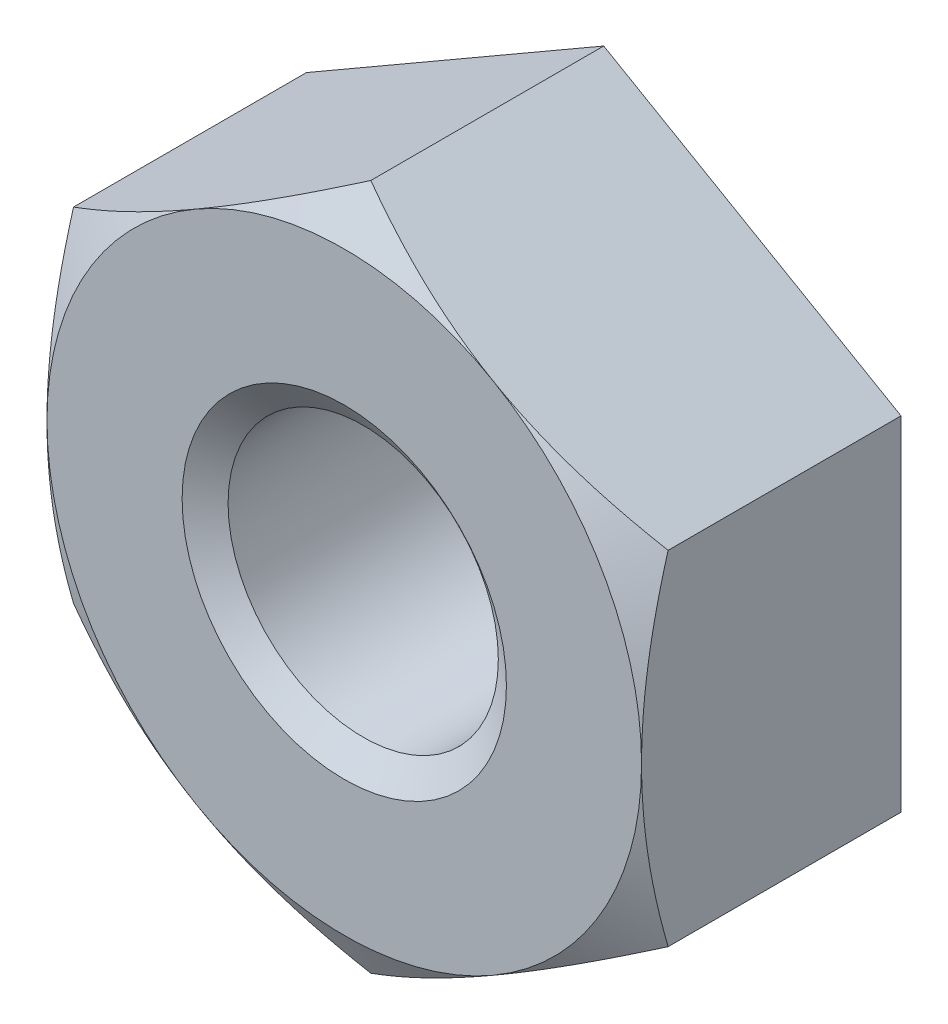
ISO-10303-21;
HEADER;
FILE_DESCRIPTION(('STEP AP214'),'2;1');
FILE_NAME('part.step','',(''),(''),'','','');
FILE_SCHEMA(('AUTOMOTIVE_DESIGN { 1 0 10303 214 1 1 1 1 }'));
ENDSEC;
DATA;
#1=APPLICATION_CONTEXT('core data for automotive mechanical design processes');
#2=APPLICATION_PROTOCOL_DEFINITION('international standard','automotive_design',2000,#1);
#3=PRODUCT_CONTEXT('',#1,'mechanical');
#4=PRODUCT('Part','Part','',(#3));
#5=PRODUCT_RELATED_PRODUCT_CATEGORY('part','',(#4));
#6=PRODUCT_DEFINITION_FORMATION('','',#4);
#7=PRODUCT_DEFINITION_CONTEXT('part definition',#1,'design');
#8=PRODUCT_DEFINITION('design','',#6,#7);
#9=PRODUCT_DEFINITION_SHAPE('','',#8);
#10=(LENGTH_UNIT() NAMED_UNIT(*) SI_UNIT(.MILLI.,.METRE.));
#11=(NAMED_UNIT(*) PLANE_ANGLE_UNIT() SI_UNIT($,.RADIAN.));
#12=(NAMED_UNIT(*) SI_UNIT($,.STERADIAN.) SOLID_ANGLE_UNIT());
#13=UNCERTAINTY_MEASURE_WITH_UNIT(LENGTH_MEASURE(1.E-05),#10,'distance_accuracy_value','');
#14=(GEOMETRIC_REPRESENTATION_CONTEXT(3) GLOBAL_UNCERTAINTY_ASSIGNED_CONTEXT((#13)) GLOBAL_UNIT_ASSIGNED_CONTEXT((#10,
#11,#12)) REPRESENTATION_CONTEXT('',''));
#15=CARTESIAN_POINT('',(0.,0.,0.));
#16=DIRECTION('',(0.,0.,1.));
#17=DIRECTION('',(1.,0.,0.));
#18=AXIS2_PLACEMENT_3D('',#15,#16,#17);
#19=CARTESIAN_POINT('',(0.,0.,-0.247093813584343));
#20=DIRECTION('',(0.,0.,-1.));
#21=DIRECTION('',(-1.,0.,0.));
#22=AXIS2_PLACEMENT_3D('',#19,#20,#21);
#23=CONICAL_SURFACE('',#22,3.17797903937844,1.04719755116195);
#24=CARTESIAN_POINT('',(0.,0.,0.));
#25=DIRECTION('',(0.,0.,-1.));
#26=DIRECTION('',(-1.,0.,0.));
#27=AXIS2_PLACEMENT_3D('',#24,#25,#26);
#28=CIRCLE('',#27,2.75000000004866);
#29=CARTESIAN_POINT('',(1.37500000001217,-2.38156986042828,1.40440906938991E-11));
#30=VERTEX_POINT('',#29);
#31=CARTESIAN_POINT('',(2.75000000002433,0.,1.40464067622389E-11));
#32=VERTEX_POINT('',#31);
#33=EDGE_CURVE('E97',#30,#32,#28,.F.);
#34=ORIENTED_EDGE('',*,*,#33,.F.);
#35=CARTESIAN_POINT('',(1.37500000000305,-2.38156986041248,3.15982768511654E-11));
#36=CARTESIAN_POINT('',(1.43336103763303,-2.34787509962212,1.12391778319675E-05));
#37=CARTESIAN_POINT('',(1.49171926381489,-2.31418196202475,-0.0014298847914334));
#38=CARTESIAN_POINT('',(1.60832112896877,-2.24686184378879,-0.00713332387259725));
#39=CARTESIAN_POINT('',(1.66656478833645,-2.21323485137477,-0.011395080477685));
#40=CARTESIAN_POINT('',(1.7825613120327,-2.14626422719404,-0.0226281862687476));
#41=CARTESIAN_POINT('',(1.8403151747034,-2.11292001903424,-0.0295858947593137));
#42=CARTESIAN_POINT('',(1.95554774065357,-2.0463904660634,-0.0460612413437182));
#43=CARTESIAN_POINT('',(2.01302643664991,-2.01320512545727,-0.0555789468186311));
#44=CARTESIAN_POINT('',(2.18481152064584,-1.91402496096951,-0.0876780317375557));
#45=CARTESIAN_POINT('',(2.29861886652214,-1.84831825919206,-0.113820966090652));
#46=CARTESIAN_POINT('',(2.52525486505283,-1.71746990443227,-0.17411325931236));
#47=CARTESIAN_POINT('',(2.63807561243877,-1.6523328155588,-0.208302603648988));
#48=CARTESIAN_POINT('',(2.75000002885947,-1.58771322360946,-0.24562010267325));
#49=B_SPLINE_CURVE_WITH_KNOTS('',3,(#35,#36,#37,#38,#39,#40,#41,#42,#43,#44,#45,#46,#47,#48),
.UNSPECIFIED.,.F.,.F.,(4,2,2,2,2,2,4),(0.,0.202147933050163,0.404255851235435,0.605354244075444,
0.806457930496686,1.20813821480532,1.61185838562082),.UNSPECIFIED.);
#50=CARTESIAN_POINT('',(2.75000001442973,-1.58771323194047,-0.245620097863339));
#51=VERTEX_POINT('',#50);
#52=EDGE_CURVE('E93',#30,#51,#49,.T.);
#53=ORIENTED_EDGE('',*,*,#52,.T.);
#54=CARTESIAN_POINT('',(2.75,-1.58771315362291,-0.245620068040142));
#55=CARTESIAN_POINT('',(2.75,-1.45847397917815,-0.208302573849282));
#56=CARTESIAN_POINT('',(2.75,-1.32819981103504,-0.174113234121537));
#57=CARTESIAN_POINT('',(2.75,-1.06650312090967,-0.113820949233789));
#58=CARTESIAN_POINT('',(2.75,-0.935089727142611,-0.0876780186143448));
#59=CARTESIAN_POINT('',(2.75,-0.736729413107964,-0.0555789383880814));
#60=CARTESIAN_POINT('',(2.75,-0.670358736932504,-0.0460612343275955));
#61=CARTESIAN_POINT('',(2.75,-0.537299641131988,-0.0295858902143288));
#62=CARTESIAN_POINT('',(2.75,-0.470611229916765,-0.0226281827805123));
#63=CARTESIAN_POINT('',(2.75,-0.336669991876295,-0.0113950787090329));
#64=CARTESIAN_POINT('',(2.75,-0.269416012265235,-0.00713332276330057));
#65=CARTESIAN_POINT('',(2.75,-0.134775786263297,-0.00142988456893094));
#66=CARTESIAN_POINT('',(2.75,-0.0673895163215359,1.12391731505966E-05));
#67=CARTESIAN_POINT('',(2.75,1.01420511404254E-12,2.80927633852003E-11));
#68=B_SPLINE_CURVE_WITH_KNOTS('',3,(#54,#55,#56,#57,#58,#59,#60,#61,#62,#63,#64,#65,#66,#67),
.UNSPECIFIED.,.F.,.F.,(4,2,2,2,2,2,4),(0.,0.403720139495963,0.805400392863833,1.00650406373458,
1.20760244102681,1.40971034347854,1.61185826077991),.UNSPECIFIED.);
#69=EDGE_CURVE('E22',#51,#32,#68,.T.);
#70=ORIENTED_EDGE('',*,*,#69,.T.);
#71=EDGE_LOOP('',(#34,#53,#70));
#72=FACE_BOUND('',#71,.T.);
#73=ADVANCED_FACE('F18',(#72),#23,.T.);
#74=CARTESIAN_POINT('',(0.,0.,-0.247093813584343));
#75=DIRECTION('',(0.,0.,-1.));
#76=DIRECTION('',(-1.,0.,0.));
#77=AXIS2_PLACEMENT_3D('',#74,#75,#76);
#78=CONICAL_SURFACE('',#77,3.17797903937844,1.04719755116195);
#79=CARTESIAN_POINT('',(2.75000000000608,0.,3.16041922148982E-11));
#80=CARTESIAN_POINT('',(2.75000000000218,0.0673895163223448,1.1239174398227E-05));
#81=CARTESIAN_POINT('',(2.75000000000058,0.134775786263928,-0.00142988456861291));
#82=CARTESIAN_POINT('',(2.74999999999941,0.269416012265561,-0.00713332276365896));
#83=CARTESIAN_POINT('',(2.74999999999984,0.336669991876494,-0.0113950787091394));
#84=CARTESIAN_POINT('',(2.75000000000016,0.470611229916732,-0.0226281827804203));
#85=CARTESIAN_POINT('',(2.75000000000004,0.537299641131852,-0.02958589021429));
#86=CARTESIAN_POINT('',(2.74999999999996,0.670358736932153,-0.0460612343275735));
#87=CARTESIAN_POINT('',(2.74999999999998,0.736729413107504,-0.0555789383880228));
#88=CARTESIAN_POINT('',(2.75000000000003,0.9350897271419,-0.0876780186141979));
#89=CARTESIAN_POINT('',(2.75000000000002,1.06650312090882,-0.113820949233605));
#90=CARTESIAN_POINT('',(2.74999999999998,1.32819981103387,-0.174113234121255));
#91=CARTESIAN_POINT('',(2.74999999999997,1.4584739791768,-0.208302573848937));
#92=CARTESIAN_POINT('',(2.75,1.58771315362139,-0.245620068039702));
#93=B_SPLINE_CURVE_WITH_KNOTS('',3,(#79,#80,#81,#82,#83,#84,#85,#86,#87,#88,#89,#90,#91,#92),
.UNSPECIFIED.,.F.,.F.,(4,2,2,2,2,2,4),(0.,0.202147917300899,0.404255819752228,0.605354197044146,
0.806457867914559,1.20813812128199,1.61185826077738),.UNSPECIFIED.);
#94=CARTESIAN_POINT('',(2.75,1.58771319694643,-0.245620080546563));
#95=VERTEX_POINT('',#94);
#96=EDGE_CURVE('E101',#32,#95,#93,.T.);
#97=ORIENTED_EDGE('',*,*,#96,.T.);
#98=CARTESIAN_POINT('',(2.75000002886078,1.58771322360869,-0.245620102673686));
#99=CARTESIAN_POINT('',(2.63807561243995,1.65233281555815,-0.208302603649328));
#100=CARTESIAN_POINT('',(2.52525486505385,1.71746990443169,-0.174113259312637));
#101=CARTESIAN_POINT('',(2.29861886652286,1.84831825919161,-0.113820966090832));
#102=CARTESIAN_POINT('',(2.18481152064644,1.91402496096912,-0.0876780317376984));
#103=CARTESIAN_POINT('',(2.01302643665031,2.01320512545705,-0.0555789468186852));
#104=CARTESIAN_POINT('',(1.95554774065389,2.04639046606325,-0.0460612413437356));
#105=CARTESIAN_POINT('',(1.84031517470349,2.11292001903413,-0.0295858947593481));
#106=CARTESIAN_POINT('',(1.78256131203265,2.14626422719388,-0.0226281862688354));
#107=CARTESIAN_POINT('',(1.66656478833636,2.21323485137499,-0.0113950804775746));
#108=CARTESIAN_POINT('',(1.60832112896878,2.24686184378946,-0.00713332387223494));
#109=CARTESIAN_POINT('',(1.49171926381405,2.31418196202455,-0.00142988479174703));
#110=CARTESIAN_POINT('',(1.43336103763123,2.34787509962063,1.12391765892145E-05));
#111=CARTESIAN_POINT('',(1.37499999999913,2.38156986040771,2.80925661016851E-11));
#112=B_SPLINE_CURVE_WITH_KNOTS('',3,(#98,#99,#100,#101,#102,#103,#104,#105,#106,#107,#108,#109,
#110,#111),.UNSPECIFIED.,.F.,.F.,(4,2,2,2,2,2,4),(0.,0.403720170816071,0.805400455125145,
1.00650414154672,1.20760253438704,1.40971045257271,1.61185838562335),.UNSPECIFIED.);
#113=CARTESIAN_POINT('',(1.37500000001217,2.38156986042827,1.40462830508427E-11));
#114=VERTEX_POINT('',#113);
#115=EDGE_CURVE('E119',#95,#114,#112,.T.);
#116=ORIENTED_EDGE('',*,*,#115,.T.);
#117=CARTESIAN_POINT('',(0.,0.,0.));
#118=DIRECTION('',(0.,0.,-1.));
#119=DIRECTION('',(-1.,0.,0.));
#120=AXIS2_PLACEMENT_3D('',#117,#118,#119);
#121=CIRCLE('',#120,2.75000000004866);
#122=EDGE_CURVE('E122',#32,#114,#121,.F.);
#123=ORIENTED_EDGE('',*,*,#122,.F.);
#124=EDGE_LOOP('',(#97,#116,#123));
#125=FACE_BOUND('',#124,.T.);
#126=ADVANCED_FACE('F123',(#125),#78,.T.);
#127=CARTESIAN_POINT('',(0.,0.,-0.247093813584343));
#128=DIRECTION('',(0.,0.,-1.));
#129=DIRECTION('',(-1.,0.,0.));
#130=AXIS2_PLACEMENT_3D('',#127,#128,#129);
#131=CONICAL_SURFACE('',#130,3.17797903937844,1.04719755116195);
#132=CARTESIAN_POINT('',(1.37500000000304,2.38156986041247,3.16043386343359E-11));
#133=CARTESIAN_POINT('',(1.31663896691706,2.41526461857035,1.12391743982664E-05));
#134=CARTESIAN_POINT('',(1.25828074528043,2.44895775353984,-0.00142988456862009));
#135=CARTESIAN_POINT('',(1.14167888919086,2.51627786653981,-0.00713332276369414));
#136=CARTESIAN_POINT('',(1.08343523434227,2.54990485634573,-0.0113950787091953));
#137=CARTESIAN_POINT('',(0.967438719584958,2.61687547536628,-0.0226281827805304));
#138=CARTESIAN_POINT('',(0.909684861334445,2.65021968097382,-0.0295858902144335));
#139=CARTESIAN_POINT('',(0.794452304166478,2.71674922887406,-0.0460612343277948));
#140=CARTESIAN_POINT('',(0.73697361253215,2.74993456696184,-0.0555789383882885));
#141=CARTESIAN_POINT('',(0.56518854147532,2.84911472397931,-0.0876780186146111));
#142=CARTESIAN_POINT('',(0.451381204075368,2.91482142086291,-0.113820949234135));
#143=CARTESIAN_POINT('',(0.224745222340224,3.04566976592572,-0.174113234122048));
#144=CARTESIAN_POINT('',(0.111924483271289,3.11080684999732,-0.208302573849875));
#145=CARTESIAN_POINT('',(7.50379077655256E-08,3.17542643721979,-0.245620068040792));
#146=B_SPLINE_CURVE_WITH_KNOTS('',3,(#132,#133,#134,#135,#136,#137,#138,#139,#140,#141,#142,
#143,#144,#145),.UNSPECIFIED.,.F.,.F.,(4,2,2,2,2,2,4),(0.,0.202147917301394,0.404255819753219,
0.605354197045627,0.806457867916529,1.20813812128493,1.61185826078131),.UNSPECIFIED.);
#147=CARTESIAN_POINT('',(3.75189542720857E-08,3.17542645888137,-0.24562008054711));
#148=VERTEX_POINT('',#147);
#149=EDGE_CURVE('E188',#114,#148,#146,.T.);
#150=ORIENTED_EDGE('',*,*,#149,.T.);
#151=CARTESIAN_POINT('',(2.88575171038922E-08,3.17542649720384,-0.2456201026726));
#152=CARTESIAN_POINT('',(-0.11192438756306,3.11080690525453,-0.208302603648394));
#153=CARTESIAN_POINT('',(-0.224745134948901,3.04566981638114,-0.174113259311847));
#154=CARTESIAN_POINT('',(-0.451381133479358,2.91482146162152,-0.113820966090303));
#155=CARTESIAN_POINT('',(-0.565188479355519,2.84911475984416,-0.0876780317372874));
#156=CARTESIAN_POINT('',(-0.736973563351236,2.74993459535647,-0.0555789468184209));
#157=CARTESIAN_POINT('',(-0.794452259347522,2.71674925475034,-0.0460612413435154));
#158=CARTESIAN_POINT('',(-0.909684825297646,2.65021970177963,-0.0295858947592054));
#159=CARTESIAN_POINT('',(-0.967438687968351,2.61687549361996,-0.022628186268726));
#160=CARTESIAN_POINT('',(-1.08343521166436,2.549904869439,-0.0113950804775193));
#161=CARTESIAN_POINT('',(-1.1416788710318,2.51627787702462,-0.0071333238722001));
#162=CARTESIAN_POINT('',(-1.25828073618624,2.4489577587897,-0.0014298847917397));
#163=CARTESIAN_POINT('',(-1.31663896236892,2.4152646211937,1.1239176589549E-05));
#164=CARTESIAN_POINT('',(-1.37500000000088,2.3815698604067,2.80927959761926E-11));
#165=B_SPLINE_CURVE_WITH_KNOTS('',3,(#151,#152,#153,#154,#155,#156,#157,#158,#159,#160,#161,
#162,#163,#164),.UNSPECIFIED.,.F.,.F.,(4,2,2,2,2,2,4),(0.,0.40372017081509,0.805400455123193,
1.00650414154428,1.20760253438411,1.40971045256929,1.61185838561943),.UNSPECIFIED.);
#166=CARTESIAN_POINT('',(-1.37500000001217,2.38156986042827,1.40462921826329E-11));
#167=VERTEX_POINT('',#166);
#168=EDGE_CURVE('E182',#148,#167,#165,.T.);
#169=ORIENTED_EDGE('',*,*,#168,.T.);
#170=CARTESIAN_POINT('',(0.,0.,0.));
#171=DIRECTION('',(0.,0.,-1.));
#172=DIRECTION('',(-1.,0.,0.));
#173=AXIS2_PLACEMENT_3D('',#170,#171,#172);
#174=CIRCLE('',#173,2.75000000004866);
#175=EDGE_CURVE('E127',#114,#167,#174,.F.);
#176=ORIENTED_EDGE('',*,*,#175,.F.);
#177=EDGE_LOOP('',(#150,#169,#176));
#178=FACE_BOUND('',#177,.T.);
#179=ADVANCED_FACE('F173',(#178),#131,.T.);
#180=CARTESIAN_POINT('',(0.,0.,-0.247093813584343));
#181=DIRECTION('',(0.,0.,-1.));
#182=DIRECTION('',(-1.,0.,0.));
#183=AXIS2_PLACEMENT_3D('',#180,#181,#182);
#184=CONICAL_SURFACE('',#183,3.17797903937844,1.04719755116195);
#185=CARTESIAN_POINT('',(0.,0.,0.));
#186=DIRECTION('',(0.,0.,-1.));
#187=DIRECTION('',(-1.,0.,0.));
#188=AXIS2_PLACEMENT_3D('',#185,#186,#187);
#189=CIRCLE('',#188,2.75000000004866);
#190=CARTESIAN_POINT('',(-2.75000000002433,0.,1.40463935830133E-11));
#191=VERTEX_POINT('',#190);
#192=EDGE_CURVE('E129',#167,#191,#189,.F.);
#193=ORIENTED_EDGE('',*,*,#192,.F.);
#194=CARTESIAN_POINT('',(-1.37500000000304,2.38156986041247,3.16045264236607E-11));
#195=CARTESIAN_POINT('',(-1.43336103763308,2.34787509962208,1.12391778372063E-05));
#196=CARTESIAN_POINT('',(-1.49171926381501,2.31418196202467,-0.00142988479143164));
#197=CARTESIAN_POINT('',(-1.608321128969,2.24686184378865,-0.00713332387260752));
#198=CARTESIAN_POINT('',(-1.66656478833674,2.21323485137459,-0.0113950804777039));
#199=CARTESIAN_POINT('',(-1.78256131203311,2.14626422719379,-0.0226281862687886));
#200=CARTESIAN_POINT('',(-1.84031517470386,2.11292001903396,-0.0295858947593684));
#201=CARTESIAN_POINT('',(-1.95554774065415,2.04639046606305,-0.046061241343805));
#202=CARTESIAN_POINT('',(-2.01302643665055,2.0132051254569,-0.0555789468187364));
#203=CARTESIAN_POINT('',(-2.18481152064664,1.91402496096904,-0.0876780317377223));
#204=CARTESIAN_POINT('',(-2.29861886652305,1.84831825919152,-0.113820966090867));
#205=CARTESIAN_POINT('',(-2.52525486505396,1.7174699044316,-0.174113259312683));
#206=CARTESIAN_POINT('',(-2.63807561244001,1.65233281555808,-0.208302603649372));
#207=CARTESIAN_POINT('',(-2.75000002886081,1.58771322360867,-0.245620102673697));
#208=B_SPLINE_CURVE_WITH_KNOTS('',3,(#194,#195,#196,#197,#198,#199,#200,#201,#202,#203,#204,
#205,#206,#207),.UNSPECIFIED.,.F.,.F.,(4,2,2,2,2,2,4),(0.,0.202147933050368,0.404255851235844,
0.605354244076056,0.8064579304975,1.20813821480654,1.61185838562244),.UNSPECIFIED.);
#209=CARTESIAN_POINT('',(-2.75000001443041,1.58771323194007,-0.245620097863561));
#210=VERTEX_POINT('',#209);
#211=EDGE_CURVE('E204',#167,#210,#208,.T.);
#212=ORIENTED_EDGE('',*,*,#211,.T.);
#213=CARTESIAN_POINT('',(-2.75,1.58771315362135,-0.245620068039692));
#214=CARTESIAN_POINT('',(-2.75,1.45847397917674,-0.208302573848903));
#215=CARTESIAN_POINT('',(-2.75,1.32819981103379,-0.174113234121225));
#216=CARTESIAN_POINT('',(-2.75,1.06650312090873,-0.113820949233596));
#217=CARTESIAN_POINT('',(-2.75,0.935089727141834,-0.0876780186142038));
#218=CARTESIAN_POINT('',(-2.75,0.736729413107428,-0.0555789383880021));
#219=CARTESIAN_POINT('',(-2.75,0.67035873693205,-0.0460612343275341));
#220=CARTESIAN_POINT('',(-2.75,0.537299641131698,-0.0295858902142976));
#221=CARTESIAN_POINT('',(-2.75,0.470611229916558,-0.0226281827804933));
#222=CARTESIAN_POINT('',(-2.75,0.336669991876254,-0.0113950787090315));
#223=CARTESIAN_POINT('',(-2.75,0.269416012265279,-0.00713332276330436));
#224=CARTESIAN_POINT('',(-2.75,0.134775786263509,-0.00142988456893813));
#225=CARTESIAN_POINT('',(-2.75,0.0673895163218324,1.12391731452491E-05));
#226=CARTESIAN_POINT('',(-2.75,-6.33431828541127E-13,2.80927558678057E-11));
#227=B_SPLINE_CURVE_WITH_KNOTS('',3,(#213,#214,#215,#216,#217,#218,#219,#220,#221,#222,#223,
#224,#225,#226),.UNSPECIFIED.,.F.,.F.,(4,2,2,2,2,2,4),(0.,0.40372013949546,0.805400392862833,
1.00650406373333,1.20760244102531,1.40971034347678,1.6118582607779),.UNSPECIFIED.);
#228=EDGE_CURVE('E208',#210,#191,#227,.T.);
#229=ORIENTED_EDGE('',*,*,#228,.T.);
#230=EDGE_LOOP('',(#193,#212,#229));
#231=FACE_BOUND('',#230,.T.);
#232=ADVANCED_FACE('F177',(#231),#184,.T.);
#233=CARTESIAN_POINT('',(0.,0.,-0.247093813584343));
#234=DIRECTION('',(0.,0.,-1.));
#235=DIRECTION('',(-1.,0.,0.));
#236=AXIS2_PLACEMENT_3D('',#233,#234,#235);
#237=CONICAL_SURFACE('',#236,3.17797903937844,1.04719755116195);
#238=CARTESIAN_POINT('',(-1.37500000000191,-2.3815698604105,3.0281960637573E-11));
#239=CARTESIAN_POINT('',(-1.31663896691665,-2.41526461856965,1.12391739200496E-05));
#240=CARTESIAN_POINT('',(-1.25828074528033,-2.44895775353965,-0.00142988456875136));
#241=CARTESIAN_POINT('',(-1.14167888919103,-2.51627786653998,-0.00713332276356876));
#242=CARTESIAN_POINT('',(-1.08343523434238,-2.54990485634574,-0.0113950787091598));
#243=CARTESIAN_POINT('',(-0.967438719585069,-2.61687547536616,-0.0226281827805537));
#244=CARTESIAN_POINT('',(-0.909684861334611,-2.65021968097372,-0.0295858902144259));
#245=CARTESIAN_POINT('',(-0.794452304166723,-2.71674922887395,-0.0460612343277534));
#246=CARTESIAN_POINT('',(-0.736973612532421,-2.7499345669617,-0.0555789383882441));
#247=CARTESIAN_POINT('',(-0.565188541475697,-2.84911472397909,-0.0876780186145429));
#248=CARTESIAN_POINT('',(-0.451381204075831,-2.91482142086265,-0.113820949234034));
#249=CARTESIAN_POINT('',(-0.224745222340844,-3.04566976592537,-0.174113234121873));
#250=CARTESIAN_POINT('',(-0.111924483271981,-3.11080684999694,-0.208302573849661));
#251=CARTESIAN_POINT('',(-7.50386605134593E-08,-3.17542643721936,-0.245620068040547));
#252=B_SPLINE_CURVE_WITH_KNOTS('',3,(#238,#239,#240,#241,#242,#243,#244,#245,#246,#247,#248,
#249,#250,#251),.UNSPECIFIED.,.F.,.F.,(4,2,2,2,2,2,4),(0.,0.202147917301335,0.404255819753073,
0.605354197045363,0.806457867916158,1.20813812128426,1.61185826078038),.UNSPECIFIED.);
#253=CARTESIAN_POINT('',(-1.37500000001217,-2.38156986042828,1.40441185215378E-11));
#254=VERTEX_POINT('',#253);
#255=CARTESIAN_POINT('',(-3.75193347858699E-08,-3.17542645888116,-0.245620080546991));
#256=VERTEX_POINT('',#255);
#257=EDGE_CURVE('E141',#254,#256,#252,.T.);
#258=ORIENTED_EDGE('',*,*,#257,.T.);
#259=CARTESIAN_POINT('',(-2.88582648343641E-08,-3.17542649720428,-0.245620102672854));
#260=CARTESIAN_POINT('',(0.111924387562372,-3.11080690525493,-0.208302603648614));
#261=CARTESIAN_POINT('',(0.224745134948273,-3.04566981638151,-0.174113259312034));
#262=CARTESIAN_POINT('',(0.451381133478852,-2.91482146162182,-0.11382096609043));
#263=CARTESIAN_POINT('',(0.565188479355074,-2.84911475984443,-0.0876780317373861));
#264=CARTESIAN_POINT('',(0.736973563350884,-2.74993459535668,-0.0555789468184861));
#265=CARTESIAN_POINT('',(0.794452259347201,-2.71674925475054,-0.0460612413435707));
#266=CARTESIAN_POINT('',(0.909684825297389,-2.65021970177979,-0.0295858947592429));
#267=CARTESIAN_POINT('',(0.967438687968126,-2.6168754936201,-0.0226281862687557));
#268=CARTESIAN_POINT('',(1.0834352116642,-2.54990486943911,-0.0113950804775364));
#269=CARTESIAN_POINT('',(1.14167887103167,-2.51627787702471,-0.00713332387221255));
#270=CARTESIAN_POINT('',(1.25828073618618,-2.44895775878974,-0.00142988479174594));
#271=CARTESIAN_POINT('',(1.31663896236889,-2.41526462119372,1.12391765848591E-05));
#272=CARTESIAN_POINT('',(1.37500000000089,-2.3815698604067,2.8088179075236E-11));
#273=B_SPLINE_CURVE_WITH_KNOTS('',3,(#259,#260,#261,#262,#263,#264,#265,#266,#267,#268,#269,
#270,#271,#272),.UNSPECIFIED.,.F.,.F.,(4,2,2,2,2,2,4),(0.,0.403720170815316,0.805400455123643,
1.00650414154485,1.20760253438479,1.40971045257008,1.61185838562033),.UNSPECIFIED.);
#274=EDGE_CURVE('E131',#256,#30,#273,.T.);
#275=ORIENTED_EDGE('',*,*,#274,.T.);
#276=CARTESIAN_POINT('',(0.,0.,0.));
#277=DIRECTION('',(0.,0.,-1.));
#278=DIRECTION('',(-1.,0.,0.));
#279=AXIS2_PLACEMENT_3D('',#276,#277,#278);
#280=CIRCLE('',#279,2.75000000004866);
#281=EDGE_CURVE('E296',#254,#30,#280,.F.);
#282=ORIENTED_EDGE('',*,*,#281,.F.);
#283=EDGE_LOOP('',(#258,#275,#282));
#284=FACE_BOUND('',#283,.T.);
#285=ADVANCED_FACE('F147',(#284),#237,.T.);
#286=CARTESIAN_POINT('',(0.,0.,0.));
#287=DIRECTION('',(0.,0.,1.));
#288=DIRECTION('',(1.,0.,0.));
#289=AXIS2_PLACEMENT_3D('',#286,#287,#288);
#290=CONICAL_SURFACE('',#289,1.50000000002137,0.959931088612035);
#291=CARTESIAN_POINT('',(0.,0.,0.));
#292=DIRECTION('',(0.,0.,1.));
#293=DIRECTION('',(1.,0.,0.));
#294=AXIS2_PLACEMENT_3D('',#291,#292,#293);
#295=CIRCLE('',#294,1.50000000002137);
#296=CARTESIAN_POINT('',(1.50000000002137,0.,0.));
#297=VERTEX_POINT('',#296);
#298=EDGE_CURVE('E292',#297,#297,#295,.F.);
#299=ORIENTED_EDGE('',*,*,#298,.F.);
#300=EDGE_LOOP('',(#299));
#301=FACE_BOUND('',#300,.T.);
#302=CARTESIAN_POINT('',(0.,0.,-0.175051884552426));
#303=DIRECTION('',(0.,0.,1.));
#304=DIRECTION('',(1.,0.,0.));
#305=AXIS2_PLACEMENT_3D('',#302,#303,#304);
#306=CIRCLE('',#305,1.25);
#307=CARTESIAN_POINT('',(1.25,0.,-0.175051884552426));
#308=VERTEX_POINT('',#307);
#309=EDGE_CURVE('E290',#308,#308,#306,.F.);
#310=ORIENTED_EDGE('',*,*,#309,.T.);
#311=EDGE_LOOP('',(#310));
#312=FACE_BOUND('',#311,.T.);
#313=ADVANCED_FACE('F247',(#301,#312),#290,.F.);
#314=CARTESIAN_POINT('',(-5.49999999999999,0.,0.));
#315=DIRECTION('',(0.,0.,1.));
#316=DIRECTION('',(1.,0.,0.));
#317=AXIS2_PLACEMENT_3D('',#314,#315,#316);
#318=PLANE('',#317);
#319=ORIENTED_EDGE('',*,*,#298,.T.);
#320=EDGE_LOOP('',(#319));
#321=FACE_BOUND('',#320,.T.);
#322=CARTESIAN_POINT('',(0.,0.,0.));
#323=DIRECTION('',(0.,0.,-1.));
#324=DIRECTION('',(-1.,0.,0.));
#325=AXIS2_PLACEMENT_3D('',#322,#323,#324);
#326=CIRCLE('',#325,2.75000000004866);
#327=EDGE_CURVE('E233',#254,#191,#326,.T.);
#328=ORIENTED_EDGE('',*,*,#327,.F.);
#329=ORIENTED_EDGE('',*,*,#281,.T.);
#330=ORIENTED_EDGE('',*,*,#33,.T.);
#331=ORIENTED_EDGE('',*,*,#122,.T.);
#332=ORIENTED_EDGE('',*,*,#175,.T.);
#333=ORIENTED_EDGE('',*,*,#192,.T.);
#334=EDGE_LOOP('',(#328,#329,#330,#331,#332,#333));
#335=FACE_BOUND('',#334,.T.);
#336=ADVANCED_FACE('F244',(#321,#335),#318,.T.);
#337=CARTESIAN_POINT('',(0.,0.,-2.4));
#338=DIRECTION('',(0.,0.,1.));
#339=DIRECTION('',(1.,0.,0.));
#340=AXIS2_PLACEMENT_3D('',#337,#338,#339);
#341=CYLINDRICAL_SURFACE('',#340,1.25);
#342=ORIENTED_EDGE('',*,*,#309,.F.);
#343=EDGE_LOOP('',(#342));
#344=FACE_BOUND('',#343,.T.);
#345=CARTESIAN_POINT('',(0.,0.,-2.19954811547041));
#346=DIRECTION('',(0.,0.,-1.));
#347=DIRECTION('',(-1.,0.,0.));
#348=AXIS2_PLACEMENT_3D('',#345,#346,#347);
#349=CIRCLE('',#348,1.24999999997044);
#350=CARTESIAN_POINT('',(-1.24999999997044,0.,-2.19954811547041));
#351=VERTEX_POINT('',#350);
#352=EDGE_CURVE('E229',#351,#351,#349,.T.);
#353=ORIENTED_EDGE('',*,*,#352,.T.);
#354=EDGE_LOOP('',(#353));
#355=FACE_BOUND('',#354,.T.);
#356=ADVANCED_FACE('F239',(#344,#355),#341,.F.);
#357=CARTESIAN_POINT('',(0.,0.,-0.247093813584343));
#358=DIRECTION('',(0.,0.,-1.));
#359=DIRECTION('',(-1.,0.,0.));
#360=AXIS2_PLACEMENT_3D('',#357,#358,#359);
#361=CONICAL_SURFACE('',#360,3.17797903937844,1.04719755116195);
#362=CARTESIAN_POINT('',(-2.75,-1.58771324027372,-0.245620093054076));
#363=CARTESIAN_POINT('',(-2.75,-1.45847405900077,-0.208302595372251));
#364=CARTESIAN_POINT('',(-2.75,-1.32819988392126,-0.174113252315721));
#365=CARTESIAN_POINT('',(-2.75,-1.06650317978837,-0.113820961408745));
#366=CARTESIAN_POINT('',(-2.75,-0.935089778952025,-0.0876780280926626));
#367=CARTESIAN_POINT('',(-2.75,-0.736729454126204,-0.0555789444770808));
#368=CARTESIAN_POINT('',(-2.75,-0.670358774312846,-0.046061239395004));
#369=CARTESIAN_POINT('',(-2.75,-0.537299671187899,-0.0295858934969783));
#370=CARTESIAN_POINT('',(-2.75,-0.470611256286145,-0.0226281852999654));
#371=CARTESIAN_POINT('',(-2.75,-0.336670010790859,-0.011395079986376));
#372=CARTESIAN_POINT('',(-2.75,-0.269416027411236,-0.00713332356424163));
#373=CARTESIAN_POINT('',(-2.75,-0.134775793848682,-0.00142988472986877));
#374=CARTESIAN_POINT('',(-2.75,-0.0673895201148583,1.12391756289694E-05));
#375=CARTESIAN_POINT('',(-2.75,6.33399438694959E-13,2.8092749761747E-11));
#376=B_SPLINE_CURVE_WITH_KNOTS('',3,(#362,#363,#364,#365,#366,#367,#368,#369,#370,#371,#372,
#373,#374,#375),.UNSPECIFIED.,.F.,.F.,(4,2,2,2,2,2,4),(0.,0.403720162116687,0.80540043783162,
1.00650411993384,1.20760250845557,1.40971042227102,1.61185835094719),.UNSPECIFIED.);
#377=CARTESIAN_POINT('',(-2.75000000000097,-1.58771324027204,-0.245620093054076));
#378=VERTEX_POINT('',#377);
#379=EDGE_CURVE('E221',#378,#191,#376,.T.);
#380=ORIENTED_EDGE('',*,*,#379,.F.);
#381=CARTESIAN_POINT('',(-1.37500000000191,-2.3815698604105,3.0281960637573E-11));
#382=CARTESIAN_POINT('',(-1.43336103636947,-2.34787510035069,1.12391764037717E-05));
#383=CARTESIAN_POINT('',(-1.49171926128878,-2.31418196348295,-0.00142988472967647));
#384=CARTESIAN_POINT('',(-1.60832112392496,-2.24686184670109,-0.00713332356447872));
#385=CARTESIAN_POINT('',(-1.66656478203751,-2.21323485501153,-0.0113950799864607));
#386=CARTESIAN_POINT('',(-1.782561303251,-2.14626423226409,-0.0226281852999396));
#387=CARTESIAN_POINT('',(-1.84031516469398,-2.11292002481316,-0.0295858934969939));
#388=CARTESIAN_POINT('',(-1.95554772820488,-2.04639047325067,-0.0460612393950495));
#389=CARTESIAN_POINT('',(-2.01302642298967,-2.01320513334402,-0.0555789444771145));
#390=CARTESIAN_POINT('',(-2.18481150339175,-1.91402497093115,-0.0876780280926777));
#391=CARTESIAN_POINT('',(-2.29861884691371,-1.84831827051298,-0.113820961408766));
#392=CARTESIAN_POINT('',(-2.5252548407794,-1.71746991844654,-0.174113252315747));
#393=CARTESIAN_POINT('',(-2.63807558585528,-1.6523328309068,-0.208302595372273));
#394=CARTESIAN_POINT('',(-2.75000000000195,-1.58771324027035,-0.245620093054076));
#395=B_SPLINE_CURVE_WITH_KNOTS('',3,(#381,#382,#383,#384,#385,#386,#387,#388,#389,#390,#391,
#392,#393,#394),.UNSPECIFIED.,.F.,.F.,(4,2,2,2,2,2,4),(0.,0.202147928675993,0.404255842491322,
0.605354231012975,0.80645791311511,1.20813818883001,1.61185835094659),.UNSPECIFIED.);
#396=EDGE_CURVE('E228',#254,#378,#395,.T.);
#397=ORIENTED_EDGE('',*,*,#396,.F.);
#398=ORIENTED_EDGE('',*,*,#327,.T.);
#399=EDGE_LOOP('',(#380,#397,#398));
#400=FACE_BOUND('',#399,.T.);
#401=ADVANCED_FACE('F235',(#400),#361,.T.);
#402=CARTESIAN_POINT('',(0.,0.,-2.37459999993916));
#403=DIRECTION('',(0.,0.,-1.));
#404=DIRECTION('',(-1.,0.,0.));
#405=AXIS2_PLACEMENT_3D('',#402,#403,#404);
#406=CONICAL_SURFACE('',#405,1.49999999985084,0.959931088612035);
#407=CARTESIAN_POINT('',(0.,0.,-2.3746));
#408=DIRECTION('',(0.,0.,1.));
#409=DIRECTION('',(1.,0.,0.));
#410=AXIS2_PLACEMENT_3D('',#407,#408,#409);
#411=CIRCLE('',#410,1.5);
#412=CARTESIAN_POINT('',(1.5,0.,-2.3746));
#413=VERTEX_POINT('',#412);
#414=EDGE_CURVE('E320',#413,#413,#411,.F.);
#415=ORIENTED_EDGE('',*,*,#414,.T.);
#416=EDGE_LOOP('',(#415));
#417=FACE_BOUND('',#416,.T.);
#418=ORIENTED_EDGE('',*,*,#352,.F.);
#419=EDGE_LOOP('',(#418));
#420=FACE_BOUND('',#419,.T.);
#421=ADVANCED_FACE('F216',(#417,#420),#406,.F.);
#422=CARTESIAN_POINT('',(-2.75,1.58771324027147,-2.4));
#423=DIRECTION('',(-1.,0.,0.));
#424=DIRECTION('',(0.,0.,1.));
#425=AXIS2_PLACEMENT_3D('',#422,#423,#424);
#426=PLANE('',#425);
#427=DIRECTION('',(0.,0.,1.));
#428=VECTOR('',#427,1.);
#429=CARTESIAN_POINT('',(-2.75,1.58771324027147,-2.4));
#430=LINE('',#429,#428);
#431=CARTESIAN_POINT('',(-2.75,1.58771324027147,-2.4));
#432=VERTEX_POINT('',#431);
#433=EDGE_CURVE('E328',#432,#210,#430,.T.);
#434=ORIENTED_EDGE('',*,*,#433,.F.);
#435=DIRECTION('',(0.,1.,0.));
#436=VECTOR('',#435,1.);
#437=CARTESIAN_POINT('',(-2.75,0.,-2.4));
#438=LINE('',#437,#436);
#439=CARTESIAN_POINT('',(-2.75,-1.58771324027148,-2.4));
#440=VERTEX_POINT('',#439);
#441=EDGE_CURVE('E285',#432,#440,#438,.F.);
#442=ORIENTED_EDGE('',*,*,#441,.T.);
#443=DIRECTION('',(0.,0.,1.));
#444=VECTOR('',#443,1.);
#445=CARTESIAN_POINT('',(-2.75,-1.58771324027148,-2.4));
#446=LINE('',#445,#444);
#447=EDGE_CURVE('E310',#378,#440,#446,.F.);
#448=ORIENTED_EDGE('',*,*,#447,.F.);
#449=ORIENTED_EDGE('',*,*,#379,.T.);
#450=ORIENTED_EDGE('',*,*,#228,.F.);
#451=EDGE_LOOP('',(#434,#442,#448,#449,#450));
#452=FACE_BOUND('',#451,.T.);
#453=ADVANCED_FACE('F212',(#452),#426,.T.);
#454=CARTESIAN_POINT('',(-2.75,-1.58771324027148,-2.4));
#455=DIRECTION('',(-0.500000000000002,-0.866025403784438,0.));
#456=DIRECTION('',(0.866025403784438,-0.500000000000002,0.));
#457=AXIS2_PLACEMENT_3D('',#454,#455,#456);
#458=PLANE('',#457);
#459=ORIENTED_EDGE('',*,*,#447,.T.);
#460=DIRECTION('',(0.866025403784438,-0.500000000000002,0.));
#461=VECTOR('',#460,1.);
#462=CARTESIAN_POINT('',(-2.75,-1.58771324027148,-2.4));
#463=LINE('',#462,#461);
#464=CARTESIAN_POINT('',(0.,-3.17542648054296,-2.4));
#465=VERTEX_POINT('',#464);
#466=EDGE_CURVE('E273',#440,#465,#463,.T.);
#467=ORIENTED_EDGE('',*,*,#466,.T.);
#468=DIRECTION('',(0.,0.,1.));
#469=VECTOR('',#468,1.);
#470=CARTESIAN_POINT('',(0.,-3.17542648054296,-2.4));
#471=LINE('',#470,#469);
#472=EDGE_CURVE('E111',#256,#465,#471,.F.);
#473=ORIENTED_EDGE('',*,*,#472,.F.);
#474=ORIENTED_EDGE('',*,*,#257,.F.);
#475=ORIENTED_EDGE('',*,*,#396,.T.);
#476=EDGE_LOOP('',(#459,#467,#473,#474,#475));
#477=FACE_BOUND('',#476,.T.);
#478=ADVANCED_FACE('F153',(#477),#458,.T.);
#479=CARTESIAN_POINT('',(0.,-3.17542648054295,-2.4));
#480=DIRECTION('',(0.500000000000001,-0.866025403784438,0.));
#481=DIRECTION('',(0.866025403784438,0.500000000000001,0.));
#482=AXIS2_PLACEMENT_3D('',#479,#480,#481);
#483=PLANE('',#482);
#484=ORIENTED_EDGE('',*,*,#472,.T.);
#485=DIRECTION('',(0.866025403784438,0.500000000000001,0.));
#486=VECTOR('',#485,1.);
#487=CARTESIAN_POINT('',(0.,-3.17542648054295,-2.4));
#488=LINE('',#487,#486);
#489=CARTESIAN_POINT('',(2.75,-1.58771324027148,-2.4));
#490=VERTEX_POINT('',#489);
#491=EDGE_CURVE('E106',#465,#490,#488,.T.);
#492=ORIENTED_EDGE('',*,*,#491,.T.);
#493=DIRECTION('',(0.,0.,1.));
#494=VECTOR('',#493,1.);
#495=CARTESIAN_POINT('',(2.75,-1.58771324027148,-2.4));
#496=LINE('',#495,#494);
#497=EDGE_CURVE('E103',#490,#51,#496,.T.);
#498=ORIENTED_EDGE('',*,*,#497,.T.);
#499=ORIENTED_EDGE('',*,*,#52,.F.);
#500=ORIENTED_EDGE('',*,*,#274,.F.);
#501=EDGE_LOOP('',(#484,#492,#498,#499,#500));
#502=FACE_BOUND('',#501,.T.);
#503=ADVANCED_FACE('F104',(#502),#483,.T.);
#504=CARTESIAN_POINT('',(2.75,1.58771324027147,-2.4));
#505=DIRECTION('',(-1.,0.,0.));
#506=DIRECTION('',(0.,0.,1.));
#507=AXIS2_PLACEMENT_3D('',#504,#505,#506);
#508=PLANE('',#507);
#509=ORIENTED_EDGE('',*,*,#497,.F.);
#510=DIRECTION('',(0.,1.,0.));
#511=VECTOR('',#510,1.);
#512=CARTESIAN_POINT('',(2.75,0.,-2.4));
#513=LINE('',#512,#511);
#514=CARTESIAN_POINT('',(2.75,1.58771324027147,-2.4));
#515=VERTEX_POINT('',#514);
#516=EDGE_CURVE('E270',#490,#515,#513,.T.);
#517=ORIENTED_EDGE('',*,*,#516,.T.);
#518=DIRECTION('',(0.,0.,1.));
#519=VECTOR('',#518,1.);
#520=CARTESIAN_POINT('',(2.75,1.58771324027147,-2.4));
#521=LINE('',#520,#519);
#522=EDGE_CURVE('E110',#95,#515,#521,.F.);
#523=ORIENTED_EDGE('',*,*,#522,.F.);
#524=ORIENTED_EDGE('',*,*,#96,.F.);
#525=ORIENTED_EDGE('',*,*,#69,.F.);
#526=EDGE_LOOP('',(#509,#517,#523,#524,#525));
#527=FACE_BOUND('',#526,.T.);
#528=ADVANCED_FACE('F114',(#527),#508,.F.);
#529=CARTESIAN_POINT('',(2.75,1.58771324027147,-2.4));
#530=DIRECTION('',(0.500000000000001,0.866025403784438,0.));
#531=DIRECTION('',(-0.866025403784438,0.500000000000001,0.));
#532=AXIS2_PLACEMENT_3D('',#529,#530,#531);
#533=PLANE('',#532);
#534=ORIENTED_EDGE('',*,*,#522,.T.);
#535=DIRECTION('',(-0.866025403784438,0.500000000000001,0.));
#536=VECTOR('',#535,1.);
#537=CARTESIAN_POINT('',(2.75,1.58771324027147,-2.4));
#538=LINE('',#537,#536);
#539=CARTESIAN_POINT('',(0.,3.17542648054295,-2.4));
#540=VERTEX_POINT('',#539);
#541=EDGE_CURVE('E269',#515,#540,#538,.T.);
#542=ORIENTED_EDGE('',*,*,#541,.T.);
#543=DIRECTION('',(0.,0.,1.));
#544=VECTOR('',#543,1.);
#545=CARTESIAN_POINT('',(0.,3.17542648054295,-2.4));
#546=LINE('',#545,#544);
#547=EDGE_CURVE('E41',#148,#540,#546,.F.);
#548=ORIENTED_EDGE('',*,*,#547,.F.);
#549=ORIENTED_EDGE('',*,*,#149,.F.);
#550=ORIENTED_EDGE('',*,*,#115,.F.);
#551=EDGE_LOOP('',(#534,#542,#548,#549,#550));
#552=FACE_BOUND('',#551,.T.);
#553=ADVANCED_FACE('F192',(#552),#533,.T.);
#554=CARTESIAN_POINT('',(0.,3.17542648054294,-2.4));
#555=DIRECTION('',(-0.500000000000001,0.866025403784438,0.));
#556=DIRECTION('',(-0.866025403784438,-0.500000000000001,0.));
#557=AXIS2_PLACEMENT_3D('',#554,#555,#556);
#558=PLANE('',#557);
#559=ORIENTED_EDGE('',*,*,#547,.T.);
#560=DIRECTION('',(-0.866025403784438,-0.500000000000001,0.));
#561=VECTOR('',#560,1.);
#562=CARTESIAN_POINT('',(0.,3.17542648054294,-2.4));
#563=LINE('',#562,#561);
#564=EDGE_CURVE('E32',#540,#432,#563,.T.);
#565=ORIENTED_EDGE('',*,*,#564,.T.);
#566=ORIENTED_EDGE('',*,*,#433,.T.);
#567=ORIENTED_EDGE('',*,*,#211,.F.);
#568=ORIENTED_EDGE('',*,*,#168,.F.);
#569=EDGE_LOOP('',(#559,#565,#566,#567,#568));
#570=FACE_BOUND('',#569,.T.);
#571=ADVANCED_FACE('F195',(#570),#558,.T.);
#572=CARTESIAN_POINT('',(0.,0.,-25.0375057290932));
#573=DIRECTION('',(0.,0.,1.));
#574=DIRECTION('',(1.,0.,0.));
#575=AXIS2_PLACEMENT_3D('',#572,#573,#574);
#576=CYLINDRICAL_SURFACE('',#575,1.5);
#577=ORIENTED_EDGE('',*,*,#414,.F.);
#578=EDGE_LOOP('',(#577));
#579=FACE_BOUND('',#578,.T.);
#580=CARTESIAN_POINT('',(0.,0.,-2.4));
#581=DIRECTION('',(0.,0.,1.));
#582=DIRECTION('',(1.,0.,0.));
#583=AXIS2_PLACEMENT_3D('',#580,#581,#582);
#584=CIRCLE('',#583,1.5);
#585=CARTESIAN_POINT('',(1.5,0.,-2.4));
#586=VERTEX_POINT('',#585);
#587=EDGE_CURVE('E11',#586,#586,#584,.F.);
#588=ORIENTED_EDGE('',*,*,#587,.T.);
#589=EDGE_LOOP('',(#588));
#590=FACE_BOUND('',#589,.T.);
#591=ADVANCED_FACE('F201',(#579,#590),#576,.F.);
#592=CARTESIAN_POINT('',(-5.49999999999999,0.,-2.4));
#593=DIRECTION('',(0.,0.,1.));
#594=DIRECTION('',(1.,0.,0.));
#595=AXIS2_PLACEMENT_3D('',#592,#593,#594);
#596=PLANE('',#595);
#597=ORIENTED_EDGE('',*,*,#587,.F.);
#598=EDGE_LOOP('',(#597));
#599=FACE_BOUND('',#598,.T.);
#600=ORIENTED_EDGE('',*,*,#541,.F.);
#601=ORIENTED_EDGE('',*,*,#516,.F.);
#602=ORIENTED_EDGE('',*,*,#491,.F.);
#603=ORIENTED_EDGE('',*,*,#466,.F.);
#604=ORIENTED_EDGE('',*,*,#441,.F.);
#605=ORIENTED_EDGE('',*,*,#564,.F.);
#606=EDGE_LOOP('',(#600,#601,#602,#603,#604,#605));
#607=FACE_BOUND('',#606,.T.);
#608=ADVANCED_FACE('F258',(#599,#607),#596,.F.);
#609=CLOSED_SHELL('',(#73,#126,#179,#232,#285,#313,#336,#356,#401,#421,#453,#478,#503,#528,#553,
#571,#591,#608));
#610=MANIFOLD_SOLID_BREP('B1',#609);
#611=ADVANCED_BREP_SHAPE_REPRESENTATION('',(#18,#610),#14);
#612=SHAPE_DEFINITION_REPRESENTATION(#9,#611);
ENDSEC;
END-ISO-10303-21;
